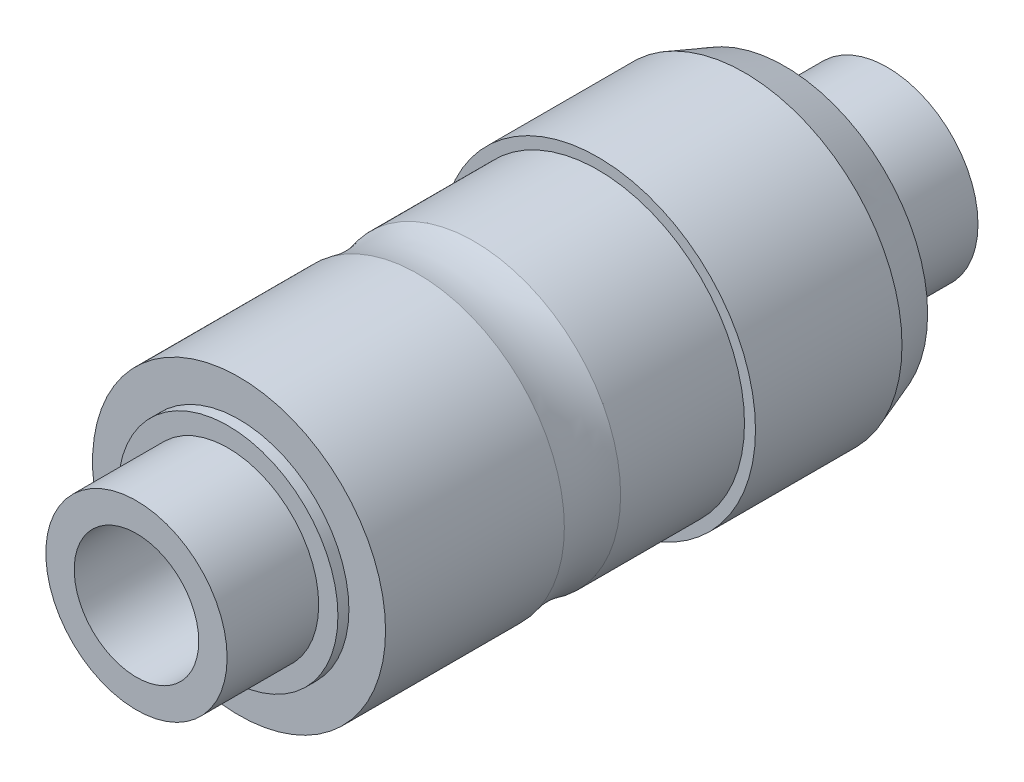
ISO-10303-21;
HEADER;
FILE_DESCRIPTION(('STEP AP214'),'2;1');
FILE_NAME('part.step','',(''),(''),'','','');
FILE_SCHEMA(('AUTOMOTIVE_DESIGN { 1 0 10303 214 1 1 1 1 }'));
ENDSEC;
DATA;
#1=APPLICATION_CONTEXT('core data for automotive mechanical design processes');
#2=APPLICATION_PROTOCOL_DEFINITION('international standard','automotive_design',2000,#1);
#3=PRODUCT_CONTEXT('',#1,'mechanical');
#4=PRODUCT('Part','Part','',(#3));
#5=PRODUCT_RELATED_PRODUCT_CATEGORY('part','',(#4));
#6=PRODUCT_DEFINITION_FORMATION('','',#4);
#7=PRODUCT_DEFINITION_CONTEXT('part definition',#1,'design');
#8=PRODUCT_DEFINITION('design','',#6,#7);
#9=PRODUCT_DEFINITION_SHAPE('','',#8);
#10=(LENGTH_UNIT() NAMED_UNIT(*) SI_UNIT(.MILLI.,.METRE.));
#11=(NAMED_UNIT(*) PLANE_ANGLE_UNIT() SI_UNIT($,.RADIAN.));
#12=(NAMED_UNIT(*) SI_UNIT($,.STERADIAN.) SOLID_ANGLE_UNIT());
#13=UNCERTAINTY_MEASURE_WITH_UNIT(LENGTH_MEASURE(1.E-05),#10,'distance_accuracy_value','');
#14=(GEOMETRIC_REPRESENTATION_CONTEXT(3) GLOBAL_UNCERTAINTY_ASSIGNED_CONTEXT((#13)) GLOBAL_UNIT_ASSIGNED_CONTEXT((#10,
#11,#12)) REPRESENTATION_CONTEXT('',''));
#15=CARTESIAN_POINT('',(0.,0.,0.));
#16=DIRECTION('',(0.,0.,1.));
#17=DIRECTION('',(1.,0.,0.));
#18=AXIS2_PLACEMENT_3D('',#15,#16,#17);
#19=CARTESIAN_POINT('',(0.,0.,5.));
#20=DIRECTION('',(0.,0.,1.));
#21=DIRECTION('',(1.,0.,0.));
#22=AXIS2_PLACEMENT_3D('',#19,#20,#21);
#23=PLANE('',#22);
#24=CARTESIAN_POINT('',(0.,0.,5.));
#25=DIRECTION('',(0.,0.,1.));
#26=DIRECTION('',(1.,0.,0.));
#27=AXIS2_PLACEMENT_3D('',#24,#25,#26);
#28=CIRCLE('',#27,4.);
#29=CARTESIAN_POINT('',(4.,0.,5.));
#30=VERTEX_POINT('',#29);
#31=EDGE_CURVE('E18',#30,#30,#28,.T.);
#32=ORIENTED_EDGE('',*,*,#31,.F.);
#33=EDGE_LOOP('',(#32));
#34=FACE_BOUND('',#33,.T.);
#35=CARTESIAN_POINT('',(0.,0.,5.));
#36=DIRECTION('',(0.,0.,1.));
#37=DIRECTION('',(1.,0.,0.));
#38=AXIS2_PLACEMENT_3D('',#35,#36,#37);
#39=CIRCLE('',#38,4.3);
#40=CARTESIAN_POINT('',(4.3,0.,5.));
#41=VERTEX_POINT('',#40);
#42=EDGE_CURVE('E62',#41,#41,#39,.F.);
#43=ORIENTED_EDGE('',*,*,#42,.F.);
#44=EDGE_LOOP('',(#43));
#45=FACE_BOUND('',#44,.T.);
#46=ADVANCED_FACE('F15',(#34,#45),#23,.T.);
#47=CARTESIAN_POINT('',(0.,0.,4.19094271260656));
#48=DIRECTION('',(0.,0.,1.));
#49=DIRECTION('',(1.,0.,0.));
#50=AXIS2_PLACEMENT_3D('',#47,#48,#49);
#51=CYLINDRICAL_SURFACE('',#50,4.);
#52=CARTESIAN_POINT('',(0.,0.,8.38188542521313));
#53=DIRECTION('',(0.,0.,1.));
#54=DIRECTION('',(1.,0.,0.));
#55=AXIS2_PLACEMENT_3D('',#52,#53,#54);
#56=CIRCLE('',#55,4.);
#57=CARTESIAN_POINT('',(4.,0.,8.38188542521313));
#58=VERTEX_POINT('',#57);
#59=EDGE_CURVE('E64',#58,#58,#56,.F.);
#60=ORIENTED_EDGE('',*,*,#59,.T.);
#61=EDGE_LOOP('',(#60));
#62=FACE_BOUND('',#61,.T.);
#63=ORIENTED_EDGE('',*,*,#31,.T.);
#64=EDGE_LOOP('',(#63));
#65=FACE_BOUND('',#64,.T.);
#66=ADVANCED_FACE('F72',(#62,#65),#51,.T.);
#67=CARTESIAN_POINT('',(0.,0.,0.));
#68=DIRECTION('',(0.,0.,1.));
#69=DIRECTION('',(1.,0.,0.));
#70=AXIS2_PLACEMENT_3D('',#67,#68,#69);
#71=CYLINDRICAL_SURFACE('',#70,4.3);
#72=CARTESIAN_POINT('',(0.,0.,0.999999999976353));
#73=DIRECTION('',(0.,0.,1.));
#74=DIRECTION('',(1.,0.,0.));
#75=AXIS2_PLACEMENT_3D('',#72,#73,#74);
#76=CIRCLE('',#75,4.30000000000064);
#77=CARTESIAN_POINT('',(4.30000000000064,0.,0.999999999976353));
#78=VERTEX_POINT('',#77);
#79=EDGE_CURVE('E68',#78,#78,#76,.F.);
#80=ORIENTED_EDGE('',*,*,#79,.F.);
#81=EDGE_LOOP('',(#80));
#82=FACE_BOUND('',#81,.T.);
#83=ORIENTED_EDGE('',*,*,#42,.T.);
#84=EDGE_LOOP('',(#83));
#85=FACE_BOUND('',#84,.T.);
#86=ADVANCED_FACE('F80',(#82,#85),#71,.T.);
#87=CARTESIAN_POINT('',(0.,0.,9.14999999999999));
#88=DIRECTION('',(0.,0.,1.));
#89=DIRECTION('',(1.,0.,0.));
#90=AXIS2_PLACEMENT_3D('',#87,#88,#89);
#91=TOROIDAL_SURFACE('',#90,6.9,3.);
#92=CARTESIAN_POINT('',(0.,0.,9.91811457478686));
#93=DIRECTION('',(0.,0.,1.));
#94=DIRECTION('',(1.,0.,0.));
#95=AXIS2_PLACEMENT_3D('',#92,#93,#94);
#96=CIRCLE('',#95,4.);
#97=CARTESIAN_POINT('',(4.,0.,9.91811457478686));
#98=VERTEX_POINT('',#97);
#99=EDGE_CURVE('E61',#98,#98,#96,.T.);
#100=ORIENTED_EDGE('',*,*,#99,.F.);
#101=EDGE_LOOP('',(#100));
#102=FACE_BOUND('',#101,.T.);
#103=ORIENTED_EDGE('',*,*,#59,.F.);
#104=EDGE_LOOP('',(#103));
#105=FACE_BOUND('',#104,.T.);
#106=ADVANCED_FACE('F136',(#102,#105),#91,.F.);
#107=CARTESIAN_POINT('',(0.,0.,0.999999999862666));
#108=DIRECTION('',(0.,0.,1.));
#109=DIRECTION('',(1.,0.,0.));
#110=AXIS2_PLACEMENT_3D('',#107,#108,#109);
#111=CONICAL_SURFACE('',#110,4.29999999994379,0.348771003585982);
#112=CARTESIAN_POINT('',(0.,0.,-0.0999999999748979));
#113=DIRECTION('',(0.,0.,1.));
#114=DIRECTION('',(1.,0.,0.));
#115=AXIS2_PLACEMENT_3D('',#112,#113,#114);
#116=CIRCLE('',#115,3.90000000000028);
#117=CARTESIAN_POINT('',(3.90000000000028,0.,-0.0999999999748979));
#118=VERTEX_POINT('',#117);
#119=EDGE_CURVE('E59',#118,#118,#116,.T.);
#120=ORIENTED_EDGE('',*,*,#119,.T.);
#121=EDGE_LOOP('',(#120));
#122=FACE_BOUND('',#121,.T.);
#123=ORIENTED_EDGE('',*,*,#79,.T.);
#124=EDGE_LOOP('',(#123));
#125=FACE_BOUND('',#124,.T.);
#126=ADVANCED_FACE('F132',(#122,#125),#111,.T.);
#127=CARTESIAN_POINT('',(0.,0.,12.3590572873934));
#128=DIRECTION('',(0.,0.,1.));
#129=DIRECTION('',(1.,0.,0.));
#130=AXIS2_PLACEMENT_3D('',#127,#128,#129);
#131=CYLINDRICAL_SURFACE('',#130,4.);
#132=CARTESIAN_POINT('',(0.,0.,14.8));
#133=DIRECTION('',(0.,0.,1.));
#134=DIRECTION('',(1.,0.,0.));
#135=AXIS2_PLACEMENT_3D('',#132,#133,#134);
#136=CIRCLE('',#135,4.);
#137=CARTESIAN_POINT('',(4.,0.,14.8));
#138=VERTEX_POINT('',#137);
#139=EDGE_CURVE('E56',#138,#138,#136,.T.);
#140=ORIENTED_EDGE('',*,*,#139,.F.);
#141=EDGE_LOOP('',(#140));
#142=FACE_BOUND('',#141,.T.);
#143=ORIENTED_EDGE('',*,*,#99,.T.);
#144=EDGE_LOOP('',(#143));
#145=FACE_BOUND('',#144,.T.);
#146=ADVANCED_FACE('F128',(#142,#145),#131,.T.);
#147=CARTESIAN_POINT('',(0.,0.,-0.100000000000002));
#148=DIRECTION('',(0.,0.,1.));
#149=DIRECTION('',(1.,0.,0.));
#150=AXIS2_PLACEMENT_3D('',#147,#148,#149);
#151=PLANE('',#150);
#152=CARTESIAN_POINT('',(0.,0.,-0.100000000000002));
#153=DIRECTION('',(0.,0.,1.));
#154=DIRECTION('',(1.,0.,0.));
#155=AXIS2_PLACEMENT_3D('',#152,#153,#154);
#156=CIRCLE('',#155,3.);
#157=CARTESIAN_POINT('',(3.,0.,-0.100000000000002));
#158=VERTEX_POINT('',#157);
#159=EDGE_CURVE('E53',#158,#158,#156,.F.);
#160=ORIENTED_EDGE('',*,*,#159,.F.);
#161=EDGE_LOOP('',(#160));
#162=FACE_BOUND('',#161,.T.);
#163=ORIENTED_EDGE('',*,*,#119,.F.);
#164=EDGE_LOOP('',(#163));
#165=FACE_BOUND('',#164,.T.);
#166=ADVANCED_FACE('F124',(#162,#165),#151,.F.);
#167=CARTESIAN_POINT('',(1.7,0.,14.8));
#168=DIRECTION('',(0.,0.,1.));
#169=DIRECTION('',(1.,0.,0.));
#170=AXIS2_PLACEMENT_3D('',#167,#168,#169);
#171=PLANE('',#170);
#172=CARTESIAN_POINT('',(0.,0.,14.8));
#173=DIRECTION('',(0.,0.,1.));
#174=DIRECTION('',(1.,0.,0.));
#175=AXIS2_PLACEMENT_3D('',#172,#173,#174);
#176=CIRCLE('',#175,3.);
#177=CARTESIAN_POINT('',(3.,0.,14.8));
#178=VERTEX_POINT('',#177);
#179=EDGE_CURVE('E50',#178,#178,#176,.T.);
#180=ORIENTED_EDGE('',*,*,#179,.F.);
#181=EDGE_LOOP('',(#180));
#182=FACE_BOUND('',#181,.T.);
#183=ORIENTED_EDGE('',*,*,#139,.T.);
#184=EDGE_LOOP('',(#183));
#185=FACE_BOUND('',#184,.T.);
#186=ADVANCED_FACE('F120',(#182,#185),#171,.T.);
#187=CARTESIAN_POINT('',(0.,0.,-0.100000000000002));
#188=DIRECTION('',(0.,0.,1.));
#189=DIRECTION('',(1.,0.,0.));
#190=AXIS2_PLACEMENT_3D('',#187,#188,#189);
#191=CYLINDRICAL_SURFACE('',#190,3.);
#192=ORIENTED_EDGE('',*,*,#159,.T.);
#193=EDGE_LOOP('',(#192));
#194=FACE_BOUND('',#193,.T.);
#195=CARTESIAN_POINT('',(0.,0.,-0.400000000000003));
#196=DIRECTION('',(0.,0.,1.));
#197=DIRECTION('',(1.,0.,0.));
#198=AXIS2_PLACEMENT_3D('',#195,#196,#197);
#199=CIRCLE('',#198,3.);
#200=CARTESIAN_POINT('',(3.,0.,-0.400000000000003));
#201=VERTEX_POINT('',#200);
#202=EDGE_CURVE('E47',#201,#201,#199,.T.);
#203=ORIENTED_EDGE('',*,*,#202,.T.);
#204=EDGE_LOOP('',(#203));
#205=FACE_BOUND('',#204,.T.);
#206=ADVANCED_FACE('F116',(#194,#205),#191,.T.);
#207=CARTESIAN_POINT('',(0.,0.,14.8));
#208=DIRECTION('',(0.,0.,1.));
#209=DIRECTION('',(1.,0.,0.));
#210=AXIS2_PLACEMENT_3D('',#207,#208,#209);
#211=CYLINDRICAL_SURFACE('',#210,3.);
#212=ORIENTED_EDGE('',*,*,#179,.T.);
#213=EDGE_LOOP('',(#212));
#214=FACE_BOUND('',#213,.T.);
#215=CARTESIAN_POINT('',(0.,0.,15.1));
#216=DIRECTION('',(0.,0.,1.));
#217=DIRECTION('',(1.,0.,0.));
#218=AXIS2_PLACEMENT_3D('',#215,#216,#217);
#219=CIRCLE('',#218,3.);
#220=CARTESIAN_POINT('',(3.,0.,15.1));
#221=VERTEX_POINT('',#220);
#222=EDGE_CURVE('E44',#221,#221,#219,.T.);
#223=ORIENTED_EDGE('',*,*,#222,.F.);
#224=EDGE_LOOP('',(#223));
#225=FACE_BOUND('',#224,.T.);
#226=ADVANCED_FACE('F112',(#214,#225),#211,.T.);
#227=CARTESIAN_POINT('',(0.,0.,-0.400000000000003));
#228=DIRECTION('',(0.,0.,1.));
#229=DIRECTION('',(1.,0.,0.));
#230=AXIS2_PLACEMENT_3D('',#227,#228,#229);
#231=PLANE('',#230);
#232=CARTESIAN_POINT('',(0.,0.,-0.400000000000003));
#233=DIRECTION('',(0.,0.,1.));
#234=DIRECTION('',(1.,0.,0.));
#235=AXIS2_PLACEMENT_3D('',#232,#233,#234);
#236=CIRCLE('',#235,2.475);
#237=CARTESIAN_POINT('',(2.475,0.,-0.400000000000003));
#238=VERTEX_POINT('',#237);
#239=EDGE_CURVE('E41',#238,#238,#236,.F.);
#240=ORIENTED_EDGE('',*,*,#239,.F.);
#241=EDGE_LOOP('',(#240));
#242=FACE_BOUND('',#241,.T.);
#243=ORIENTED_EDGE('',*,*,#202,.F.);
#244=EDGE_LOOP('',(#243));
#245=FACE_BOUND('',#244,.T.);
#246=ADVANCED_FACE('F108',(#242,#245),#231,.F.);
#247=CARTESIAN_POINT('',(0.,0.,15.1));
#248=DIRECTION('',(0.,0.,1.));
#249=DIRECTION('',(1.,0.,0.));
#250=AXIS2_PLACEMENT_3D('',#247,#248,#249);
#251=PLANE('',#250);
#252=CARTESIAN_POINT('',(0.,0.,15.1));
#253=DIRECTION('',(0.,0.,1.));
#254=DIRECTION('',(1.,0.,0.));
#255=AXIS2_PLACEMENT_3D('',#252,#253,#254);
#256=CIRCLE('',#255,2.475);
#257=CARTESIAN_POINT('',(2.475,0.,15.1));
#258=VERTEX_POINT('',#257);
#259=EDGE_CURVE('E38',#258,#258,#256,.T.);
#260=ORIENTED_EDGE('',*,*,#259,.F.);
#261=EDGE_LOOP('',(#260));
#262=FACE_BOUND('',#261,.T.);
#263=ORIENTED_EDGE('',*,*,#222,.T.);
#264=EDGE_LOOP('',(#263));
#265=FACE_BOUND('',#264,.T.);
#266=ADVANCED_FACE('F104',(#262,#265),#251,.T.);
#267=CARTESIAN_POINT('',(0.,0.,-0.100000000000002));
#268=DIRECTION('',(0.,0.,1.));
#269=DIRECTION('',(1.,0.,0.));
#270=AXIS2_PLACEMENT_3D('',#267,#268,#269);
#271=CYLINDRICAL_SURFACE('',#270,2.475);
#272=ORIENTED_EDGE('',*,*,#239,.T.);
#273=EDGE_LOOP('',(#272));
#274=FACE_BOUND('',#273,.T.);
#275=CARTESIAN_POINT('',(0.,0.,-2.9));
#276=DIRECTION('',(0.,0.,1.));
#277=DIRECTION('',(1.,0.,0.));
#278=AXIS2_PLACEMENT_3D('',#275,#276,#277);
#279=CIRCLE('',#278,2.475);
#280=CARTESIAN_POINT('',(2.475,0.,-2.9));
#281=VERTEX_POINT('',#280);
#282=EDGE_CURVE('E35',#281,#281,#279,.T.);
#283=ORIENTED_EDGE('',*,*,#282,.T.);
#284=EDGE_LOOP('',(#283));
#285=FACE_BOUND('',#284,.T.);
#286=ADVANCED_FACE('F100',(#274,#285),#271,.T.);
#287=CARTESIAN_POINT('',(0.,0.,14.8));
#288=DIRECTION('',(0.,0.,1.));
#289=DIRECTION('',(1.,0.,0.));
#290=AXIS2_PLACEMENT_3D('',#287,#288,#289);
#291=CYLINDRICAL_SURFACE('',#290,2.475);
#292=ORIENTED_EDGE('',*,*,#259,.T.);
#293=EDGE_LOOP('',(#292));
#294=FACE_BOUND('',#293,.T.);
#295=CARTESIAN_POINT('',(0.,0.,17.6));
#296=DIRECTION('',(0.,0.,1.));
#297=DIRECTION('',(1.,0.,0.));
#298=AXIS2_PLACEMENT_3D('',#295,#296,#297);
#299=CIRCLE('',#298,2.475);
#300=CARTESIAN_POINT('',(2.475,0.,17.6));
#301=VERTEX_POINT('',#300);
#302=EDGE_CURVE('E27',#301,#301,#299,.T.);
#303=ORIENTED_EDGE('',*,*,#302,.F.);
#304=EDGE_LOOP('',(#303));
#305=FACE_BOUND('',#304,.T.);
#306=ADVANCED_FACE('F96',(#294,#305),#291,.T.);
#307=CARTESIAN_POINT('',(0.,0.,-2.9));
#308=DIRECTION('',(0.,0.,1.));
#309=DIRECTION('',(1.,0.,0.));
#310=AXIS2_PLACEMENT_3D('',#307,#308,#309);
#311=PLANE('',#310);
#312=CARTESIAN_POINT('',(0.,0.,-2.9));
#313=DIRECTION('',(0.,0.,1.));
#314=DIRECTION('',(1.,0.,0.));
#315=AXIS2_PLACEMENT_3D('',#312,#313,#314);
#316=CIRCLE('',#315,1.7);
#317=CARTESIAN_POINT('',(1.7,0.,-2.9));
#318=VERTEX_POINT('',#317);
#319=EDGE_CURVE('E22',#318,#318,#316,.T.);
#320=ORIENTED_EDGE('',*,*,#319,.T.);
#321=EDGE_LOOP('',(#320));
#322=FACE_BOUND('',#321,.T.);
#323=ORIENTED_EDGE('',*,*,#282,.F.);
#324=EDGE_LOOP('',(#323));
#325=FACE_BOUND('',#324,.T.);
#326=ADVANCED_FACE('F90',(#322,#325),#311,.F.);
#327=CARTESIAN_POINT('',(0.,0.,17.6));
#328=DIRECTION('',(0.,0.,1.));
#329=DIRECTION('',(1.,0.,0.));
#330=AXIS2_PLACEMENT_3D('',#327,#328,#329);
#331=PLANE('',#330);
#332=CARTESIAN_POINT('',(0.,0.,17.6));
#333=DIRECTION('',(0.,0.,1.));
#334=DIRECTION('',(1.,0.,0.));
#335=AXIS2_PLACEMENT_3D('',#332,#333,#334);
#336=CIRCLE('',#335,1.7);
#337=CARTESIAN_POINT('',(1.7,0.,17.6));
#338=VERTEX_POINT('',#337);
#339=EDGE_CURVE('E10',#338,#338,#336,.F.);
#340=ORIENTED_EDGE('',*,*,#339,.T.);
#341=EDGE_LOOP('',(#340));
#342=FACE_BOUND('',#341,.T.);
#343=ORIENTED_EDGE('',*,*,#302,.T.);
#344=EDGE_LOOP('',(#343));
#345=FACE_BOUND('',#344,.T.);
#346=ADVANCED_FACE('F84',(#342,#345),#331,.T.);
#347=CARTESIAN_POINT('',(0.,0.,1.5));
#348=DIRECTION('',(0.,0.,1.));
#349=DIRECTION('',(1.,0.,0.));
#350=AXIS2_PLACEMENT_3D('',#347,#348,#349);
#351=CYLINDRICAL_SURFACE('',#350,1.7);
#352=ORIENTED_EDGE('',*,*,#339,.F.);
#353=EDGE_LOOP('',(#352));
#354=FACE_BOUND('',#353,.T.);
#355=ORIENTED_EDGE('',*,*,#319,.F.);
#356=EDGE_LOOP('',(#355));
#357=FACE_BOUND('',#356,.T.);
#358=ADVANCED_FACE('F82',(#354,#357),#351,.F.);
#359=CLOSED_SHELL('',(#46,#66,#86,#106,#126,#146,#166,#186,#206,#226,#246,#266,#286,#306,#326,
#346,#358));
#360=MANIFOLD_SOLID_BREP('B1',#359);
#361=ADVANCED_BREP_SHAPE_REPRESENTATION('',(#18,#360),#14);
#362=SHAPE_DEFINITION_REPRESENTATION(#9,#361);
ENDSEC;
END-ISO-10303-21;
